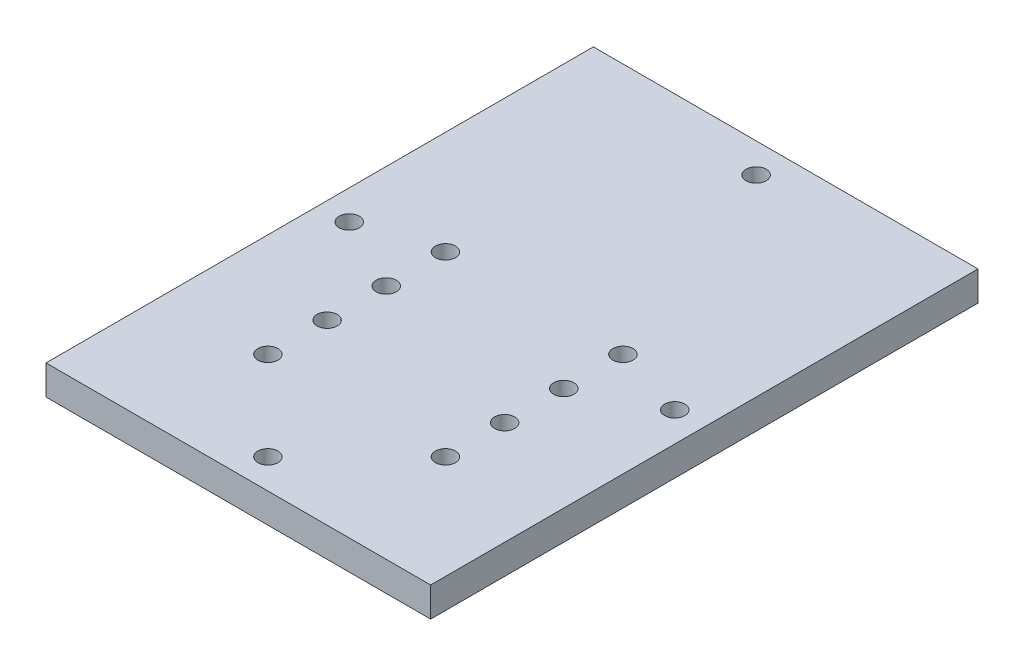
ISO-10303-21;
HEADER;
FILE_DESCRIPTION(('STEP AP214'),'2;1');
FILE_NAME('part.step','',(''),(''),'','','');
FILE_SCHEMA(('AUTOMOTIVE_DESIGN { 1 0 10303 214 1 1 1 1 }'));
ENDSEC;
DATA;
#1=APPLICATION_CONTEXT('core data for automotive mechanical design processes');
#2=APPLICATION_PROTOCOL_DEFINITION('international standard','automotive_design',2000,#1);
#3=PRODUCT_CONTEXT('',#1,'mechanical');
#4=PRODUCT('Part','Part','',(#3));
#5=PRODUCT_RELATED_PRODUCT_CATEGORY('part','',(#4));
#6=PRODUCT_DEFINITION_FORMATION('','',#4);
#7=PRODUCT_DEFINITION_CONTEXT('part definition',#1,'design');
#8=PRODUCT_DEFINITION('design','',#6,#7);
#9=PRODUCT_DEFINITION_SHAPE('','',#8);
#10=(LENGTH_UNIT() NAMED_UNIT(*) SI_UNIT(.MILLI.,.METRE.));
#11=(NAMED_UNIT(*) PLANE_ANGLE_UNIT() SI_UNIT($,.RADIAN.));
#12=(NAMED_UNIT(*) SI_UNIT($,.STERADIAN.) SOLID_ANGLE_UNIT());
#13=UNCERTAINTY_MEASURE_WITH_UNIT(LENGTH_MEASURE(1.E-05),#10,'distance_accuracy_value','');
#14=(GEOMETRIC_REPRESENTATION_CONTEXT(3) GLOBAL_UNCERTAINTY_ASSIGNED_CONTEXT((#13)) GLOBAL_UNIT_ASSIGNED_CONTEXT((#10,
#11,#12)) REPRESENTATION_CONTEXT('',''));
#15=CARTESIAN_POINT('',(0.,0.,0.));
#16=DIRECTION('',(0.,0.,1.));
#17=DIRECTION('',(1.,0.,0.));
#18=AXIS2_PLACEMENT_3D('',#15,#16,#17);
#19=CARTESIAN_POINT('',(0.,25.4,0.));
#20=DIRECTION('',(0.,1.,0.));
#21=DIRECTION('',(0.,0.,1.));
#22=AXIS2_PLACEMENT_3D('',#19,#20,#21);
#23=PLANE('',#22);
#24=CARTESIAN_POINT('',(-241.3,25.4,-203.2));
#25=DIRECTION('',(0.,1.,0.));
#26=DIRECTION('',(0.,0.,1.));
#27=AXIS2_PLACEMENT_3D('',#24,#25,#26);
#28=CIRCLE('',#27,8.64870000000001);
#29=CARTESIAN_POINT('',(-241.3,25.4,-194.5513));
#30=VERTEX_POINT('',#29);
#31=EDGE_CURVE('E179',#30,#30,#28,.T.);
#32=ORIENTED_EDGE('',*,*,#31,.F.);
#33=EDGE_LOOP('',(#32));
#34=FACE_BOUND('',#33,.T.);
#35=CARTESIAN_POINT('',(-241.3,25.4,-101.6));
#36=DIRECTION('',(0.,1.,0.));
#37=DIRECTION('',(0.,0.,1.));
#38=AXIS2_PLACEMENT_3D('',#35,#36,#37);
#39=CIRCLE('',#38,8.64870000000001);
#40=CARTESIAN_POINT('',(-241.3,25.4,-92.9513));
#41=VERTEX_POINT('',#40);
#42=EDGE_CURVE('E167',#41,#41,#39,.T.);
#43=ORIENTED_EDGE('',*,*,#42,.F.);
#44=EDGE_LOOP('',(#43));
#45=FACE_BOUND('',#44,.T.);
#46=CARTESIAN_POINT('',(-88.9,25.4,-203.2));
#47=DIRECTION('',(0.,1.,0.));
#48=DIRECTION('',(0.,0.,1.));
#49=AXIS2_PLACEMENT_3D('',#46,#47,#48);
#50=CIRCLE('',#49,8.64869999999993);
#51=CARTESIAN_POINT('',(-88.9,25.4,-194.5513));
#52=VERTEX_POINT('',#51);
#53=EDGE_CURVE('E155',#52,#52,#50,.T.);
#54=ORIENTED_EDGE('',*,*,#53,.F.);
#55=EDGE_LOOP('',(#54));
#56=FACE_BOUND('',#55,.T.);
#57=CARTESIAN_POINT('',(-88.9,25.4,-101.6));
#58=DIRECTION('',(0.,1.,0.));
#59=DIRECTION('',(0.,0.,1.));
#60=AXIS2_PLACEMENT_3D('',#57,#58,#59);
#61=CIRCLE('',#60,8.64869999999999);
#62=CARTESIAN_POINT('',(-88.9,25.4,-92.9513));
#63=VERTEX_POINT('',#62);
#64=EDGE_CURVE('E143',#63,#63,#61,.T.);
#65=ORIENTED_EDGE('',*,*,#64,.F.);
#66=EDGE_LOOP('',(#65));
#67=FACE_BOUND('',#66,.T.);
#68=CARTESIAN_POINT('',(-165.1,25.4,-25.4));
#69=DIRECTION('',(0.,1.,0.));
#70=DIRECTION('',(0.,0.,1.));
#71=AXIS2_PLACEMENT_3D('',#68,#69,#70);
#72=CIRCLE('',#71,8.64870000000001);
#73=CARTESIAN_POINT('',(-165.1,25.4,-16.7513));
#74=VERTEX_POINT('',#73);
#75=EDGE_CURVE('E131',#74,#74,#72,.T.);
#76=ORIENTED_EDGE('',*,*,#75,.F.);
#77=EDGE_LOOP('',(#76));
#78=FACE_BOUND('',#77,.T.);
#79=CARTESIAN_POINT('',(-165.1,25.4,-444.5));
#80=DIRECTION('',(0.,1.,0.));
#81=DIRECTION('',(0.,0.,1.));
#82=AXIS2_PLACEMENT_3D('',#79,#80,#81);
#83=CIRCLE('',#82,8.6487);
#84=CARTESIAN_POINT('',(-165.1,25.4,-435.8513));
#85=VERTEX_POINT('',#84);
#86=EDGE_CURVE('E110',#85,#85,#83,.T.);
#87=ORIENTED_EDGE('',*,*,#86,.F.);
#88=EDGE_LOOP('',(#87));
#89=FACE_BOUND('',#88,.T.);
#90=DIRECTION('',(0.,0.,-1.));
#91=VECTOR('',#90,1.);
#92=CARTESIAN_POINT('',(0.,25.4,0.));
#93=LINE('',#92,#91);
#94=CARTESIAN_POINT('',(0.,25.4,0.));
#95=VERTEX_POINT('',#94);
#96=CARTESIAN_POINT('',(0.,25.4,-469.9));
#97=VERTEX_POINT('',#96);
#98=EDGE_CURVE('E95',#95,#97,#93,.T.);
#99=ORIENTED_EDGE('',*,*,#98,.T.);
#100=DIRECTION('',(-1.,0.,0.));
#101=VECTOR('',#100,1.);
#102=CARTESIAN_POINT('',(0.,25.4,-469.9));
#103=LINE('',#102,#101);
#104=CARTESIAN_POINT('',(-330.2,25.4,-469.9));
#105=VERTEX_POINT('',#104);
#106=EDGE_CURVE('E90',#97,#105,#103,.T.);
#107=ORIENTED_EDGE('',*,*,#106,.T.);
#108=DIRECTION('',(0.,0.,1.));
#109=VECTOR('',#108,1.);
#110=CARTESIAN_POINT('',(-330.2,25.4,0.));
#111=LINE('',#110,#109);
#112=CARTESIAN_POINT('',(-330.2,25.4,0.));
#113=VERTEX_POINT('',#112);
#114=EDGE_CURVE('E93',#105,#113,#111,.T.);
#115=ORIENTED_EDGE('',*,*,#114,.T.);
#116=DIRECTION('',(1.,0.,0.));
#117=VECTOR('',#116,1.);
#118=CARTESIAN_POINT('',(0.,25.4,0.));
#119=LINE('',#118,#117);
#120=EDGE_CURVE('E60',#113,#95,#119,.T.);
#121=ORIENTED_EDGE('',*,*,#120,.T.);
#122=EDGE_LOOP('',(#99,#107,#115,#121));
#123=FACE_BOUND('',#122,.T.);
#124=CARTESIAN_POINT('',(-25.4,25.4,-234.95));
#125=DIRECTION('',(0.,1.,0.));
#126=DIRECTION('',(0.,0.,1.));
#127=AXIS2_PLACEMENT_3D('',#124,#125,#126);
#128=CIRCLE('',#127,8.6487);
#129=CARTESIAN_POINT('',(-25.4,25.4,-226.3013));
#130=VERTEX_POINT('',#129);
#131=EDGE_CURVE('E125',#130,#130,#128,.T.);
#132=ORIENTED_EDGE('',*,*,#131,.F.);
#133=EDGE_LOOP('',(#132));
#134=FACE_BOUND('',#133,.T.);
#135=CARTESIAN_POINT('',(-304.8,25.4,-234.95));
#136=DIRECTION('',(0.,1.,0.));
#137=DIRECTION('',(0.,0.,1.));
#138=AXIS2_PLACEMENT_3D('',#135,#136,#137);
#139=CIRCLE('',#138,8.64870000000001);
#140=CARTESIAN_POINT('',(-304.8,25.4,-226.3013));
#141=VERTEX_POINT('',#140);
#142=EDGE_CURVE('E137',#141,#141,#139,.T.);
#143=ORIENTED_EDGE('',*,*,#142,.F.);
#144=EDGE_LOOP('',(#143));
#145=FACE_BOUND('',#144,.T.);
#146=CARTESIAN_POINT('',(-88.9,25.4,-152.4));
#147=DIRECTION('',(0.,1.,0.));
#148=DIRECTION('',(0.,0.,1.));
#149=AXIS2_PLACEMENT_3D('',#146,#147,#148);
#150=CIRCLE('',#149,8.64869999999999);
#151=CARTESIAN_POINT('',(-88.9,25.4,-143.7513));
#152=VERTEX_POINT('',#151);
#153=EDGE_CURVE('E149',#152,#152,#150,.T.);
#154=ORIENTED_EDGE('',*,*,#153,.F.);
#155=EDGE_LOOP('',(#154));
#156=FACE_BOUND('',#155,.T.);
#157=CARTESIAN_POINT('',(-88.9,25.4,-254.));
#158=DIRECTION('',(0.,1.,0.));
#159=DIRECTION('',(0.,0.,1.));
#160=AXIS2_PLACEMENT_3D('',#157,#158,#159);
#161=CIRCLE('',#160,8.64869999999982);
#162=CARTESIAN_POINT('',(-88.9,25.4,-245.3513));
#163=VERTEX_POINT('',#162);
#164=EDGE_CURVE('E161',#163,#163,#161,.T.);
#165=ORIENTED_EDGE('',*,*,#164,.F.);
#166=EDGE_LOOP('',(#165));
#167=FACE_BOUND('',#166,.T.);
#168=CARTESIAN_POINT('',(-241.3,25.4,-152.4));
#169=DIRECTION('',(0.,1.,0.));
#170=DIRECTION('',(0.,0.,1.));
#171=AXIS2_PLACEMENT_3D('',#168,#169,#170);
#172=CIRCLE('',#171,8.64870000000001);
#173=CARTESIAN_POINT('',(-241.3,25.4,-143.7513));
#174=VERTEX_POINT('',#173);
#175=EDGE_CURVE('E173',#174,#174,#172,.T.);
#176=ORIENTED_EDGE('',*,*,#175,.F.);
#177=EDGE_LOOP('',(#176));
#178=FACE_BOUND('',#177,.T.);
#179=CARTESIAN_POINT('',(-241.3,25.4,-254.));
#180=DIRECTION('',(0.,1.,0.));
#181=DIRECTION('',(0.,0.,1.));
#182=AXIS2_PLACEMENT_3D('',#179,#180,#181);
#183=CIRCLE('',#182,8.6487);
#184=CARTESIAN_POINT('',(-241.3,25.4,-245.3513));
#185=VERTEX_POINT('',#184);
#186=EDGE_CURVE('E185',#185,#185,#183,.T.);
#187=ORIENTED_EDGE('',*,*,#186,.F.);
#188=EDGE_LOOP('',(#187));
#189=FACE_BOUND('',#188,.T.);
#190=ADVANCED_FACE('F43',(#34,#45,#56,#67,#78,#89,#123,#134,#145,#156,#167,#178,#189),#23,.T.);
#191=CARTESIAN_POINT('',(0.,0.,0.));
#192=DIRECTION('',(0.,1.,0.));
#193=DIRECTION('',(0.,0.,1.));
#194=AXIS2_PLACEMENT_3D('',#191,#192,#193);
#195=PLANE('',#194);
#196=DIRECTION('',(0.,0.,-1.));
#197=VECTOR('',#196,1.);
#198=CARTESIAN_POINT('',(0.,0.,0.));
#199=LINE('',#198,#197);
#200=CARTESIAN_POINT('',(0.,0.,0.));
#201=VERTEX_POINT('',#200);
#202=CARTESIAN_POINT('',(0.,0.,-469.9));
#203=VERTEX_POINT('',#202);
#204=EDGE_CURVE('E107',#201,#203,#199,.T.);
#205=ORIENTED_EDGE('',*,*,#204,.F.);
#206=DIRECTION('',(1.,0.,0.));
#207=VECTOR('',#206,1.);
#208=CARTESIAN_POINT('',(0.,0.,0.));
#209=LINE('',#208,#207);
#210=CARTESIAN_POINT('',(-330.2,0.,0.));
#211=VERTEX_POINT('',#210);
#212=EDGE_CURVE('E83',#211,#201,#209,.T.);
#213=ORIENTED_EDGE('',*,*,#212,.F.);
#214=DIRECTION('',(0.,0.,1.));
#215=VECTOR('',#214,1.);
#216=CARTESIAN_POINT('',(-330.2,0.,0.));
#217=LINE('',#216,#215);
#218=CARTESIAN_POINT('',(-330.2,0.,-469.9));
#219=VERTEX_POINT('',#218);
#220=EDGE_CURVE('E77',#219,#211,#217,.T.);
#221=ORIENTED_EDGE('',*,*,#220,.F.);
#222=DIRECTION('',(-1.,0.,0.));
#223=VECTOR('',#222,1.);
#224=CARTESIAN_POINT('',(0.,0.,-469.9));
#225=LINE('',#224,#223);
#226=EDGE_CURVE('E99',#203,#219,#225,.T.);
#227=ORIENTED_EDGE('',*,*,#226,.F.);
#228=EDGE_LOOP('',(#205,#213,#221,#227));
#229=FACE_BOUND('',#228,.T.);
#230=CARTESIAN_POINT('',(-165.1,0.,-444.5));
#231=DIRECTION('',(0.,1.,0.));
#232=DIRECTION('',(0.,0.,1.));
#233=AXIS2_PLACEMENT_3D('',#230,#231,#232);
#234=CIRCLE('',#233,8.6487);
#235=CARTESIAN_POINT('',(-165.1,0.,-435.8513));
#236=VERTEX_POINT('',#235);
#237=EDGE_CURVE('E122',#236,#236,#234,.T.);
#238=ORIENTED_EDGE('',*,*,#237,.T.);
#239=EDGE_LOOP('',(#238));
#240=FACE_BOUND('',#239,.T.);
#241=CARTESIAN_POINT('',(-25.4,0.,-234.95));
#242=DIRECTION('',(0.,1.,0.));
#243=DIRECTION('',(0.,0.,1.));
#244=AXIS2_PLACEMENT_3D('',#241,#242,#243);
#245=CIRCLE('',#244,8.6487);
#246=CARTESIAN_POINT('',(-25.4,0.,-226.3013));
#247=VERTEX_POINT('',#246);
#248=EDGE_CURVE('E128',#247,#247,#245,.T.);
#249=ORIENTED_EDGE('',*,*,#248,.T.);
#250=EDGE_LOOP('',(#249));
#251=FACE_BOUND('',#250,.T.);
#252=CARTESIAN_POINT('',(-165.1,0.,-25.4));
#253=DIRECTION('',(0.,1.,0.));
#254=DIRECTION('',(0.,0.,1.));
#255=AXIS2_PLACEMENT_3D('',#252,#253,#254);
#256=CIRCLE('',#255,8.64870000000001);
#257=CARTESIAN_POINT('',(-165.1,0.,-16.7513));
#258=VERTEX_POINT('',#257);
#259=EDGE_CURVE('E134',#258,#258,#256,.T.);
#260=ORIENTED_EDGE('',*,*,#259,.T.);
#261=EDGE_LOOP('',(#260));
#262=FACE_BOUND('',#261,.T.);
#263=CARTESIAN_POINT('',(-304.8,0.,-234.95));
#264=DIRECTION('',(0.,1.,0.));
#265=DIRECTION('',(0.,0.,1.));
#266=AXIS2_PLACEMENT_3D('',#263,#264,#265);
#267=CIRCLE('',#266,8.64870000000001);
#268=CARTESIAN_POINT('',(-304.8,0.,-226.3013));
#269=VERTEX_POINT('',#268);
#270=EDGE_CURVE('E140',#269,#269,#267,.T.);
#271=ORIENTED_EDGE('',*,*,#270,.T.);
#272=EDGE_LOOP('',(#271));
#273=FACE_BOUND('',#272,.T.);
#274=CARTESIAN_POINT('',(-88.9,0.,-101.6));
#275=DIRECTION('',(0.,1.,0.));
#276=DIRECTION('',(0.,0.,1.));
#277=AXIS2_PLACEMENT_3D('',#274,#275,#276);
#278=CIRCLE('',#277,8.64869999999999);
#279=CARTESIAN_POINT('',(-88.9,0.,-92.9513));
#280=VERTEX_POINT('',#279);
#281=EDGE_CURVE('E146',#280,#280,#278,.T.);
#282=ORIENTED_EDGE('',*,*,#281,.T.);
#283=EDGE_LOOP('',(#282));
#284=FACE_BOUND('',#283,.T.);
#285=CARTESIAN_POINT('',(-88.9,0.,-152.4));
#286=DIRECTION('',(0.,1.,0.));
#287=DIRECTION('',(0.,0.,1.));
#288=AXIS2_PLACEMENT_3D('',#285,#286,#287);
#289=CIRCLE('',#288,8.64869999999999);
#290=CARTESIAN_POINT('',(-88.9,0.,-143.7513));
#291=VERTEX_POINT('',#290);
#292=EDGE_CURVE('E152',#291,#291,#289,.T.);
#293=ORIENTED_EDGE('',*,*,#292,.T.);
#294=EDGE_LOOP('',(#293));
#295=FACE_BOUND('',#294,.T.);
#296=CARTESIAN_POINT('',(-88.9,0.,-203.2));
#297=DIRECTION('',(0.,1.,0.));
#298=DIRECTION('',(0.,0.,1.));
#299=AXIS2_PLACEMENT_3D('',#296,#297,#298);
#300=CIRCLE('',#299,8.64869999999993);
#301=CARTESIAN_POINT('',(-88.9,0.,-194.5513));
#302=VERTEX_POINT('',#301);
#303=EDGE_CURVE('E158',#302,#302,#300,.T.);
#304=ORIENTED_EDGE('',*,*,#303,.T.);
#305=EDGE_LOOP('',(#304));
#306=FACE_BOUND('',#305,.T.);
#307=CARTESIAN_POINT('',(-88.9,0.,-254.));
#308=DIRECTION('',(0.,1.,0.));
#309=DIRECTION('',(0.,0.,1.));
#310=AXIS2_PLACEMENT_3D('',#307,#308,#309);
#311=CIRCLE('',#310,8.64869999999982);
#312=CARTESIAN_POINT('',(-88.9,0.,-245.3513));
#313=VERTEX_POINT('',#312);
#314=EDGE_CURVE('E164',#313,#313,#311,.T.);
#315=ORIENTED_EDGE('',*,*,#314,.T.);
#316=EDGE_LOOP('',(#315));
#317=FACE_BOUND('',#316,.T.);
#318=CARTESIAN_POINT('',(-241.3,0.,-101.6));
#319=DIRECTION('',(0.,1.,0.));
#320=DIRECTION('',(0.,0.,1.));
#321=AXIS2_PLACEMENT_3D('',#318,#319,#320);
#322=CIRCLE('',#321,8.64870000000001);
#323=CARTESIAN_POINT('',(-241.3,0.,-92.9513));
#324=VERTEX_POINT('',#323);
#325=EDGE_CURVE('E170',#324,#324,#322,.T.);
#326=ORIENTED_EDGE('',*,*,#325,.T.);
#327=EDGE_LOOP('',(#326));
#328=FACE_BOUND('',#327,.T.);
#329=CARTESIAN_POINT('',(-241.3,0.,-152.4));
#330=DIRECTION('',(0.,1.,0.));
#331=DIRECTION('',(0.,0.,1.));
#332=AXIS2_PLACEMENT_3D('',#329,#330,#331);
#333=CIRCLE('',#332,8.64870000000001);
#334=CARTESIAN_POINT('',(-241.3,0.,-143.7513));
#335=VERTEX_POINT('',#334);
#336=EDGE_CURVE('E176',#335,#335,#333,.T.);
#337=ORIENTED_EDGE('',*,*,#336,.T.);
#338=EDGE_LOOP('',(#337));
#339=FACE_BOUND('',#338,.T.);
#340=CARTESIAN_POINT('',(-241.3,0.,-203.2));
#341=DIRECTION('',(0.,1.,0.));
#342=DIRECTION('',(0.,0.,1.));
#343=AXIS2_PLACEMENT_3D('',#340,#341,#342);
#344=CIRCLE('',#343,8.64870000000001);
#345=CARTESIAN_POINT('',(-241.3,0.,-194.5513));
#346=VERTEX_POINT('',#345);
#347=EDGE_CURVE('E182',#346,#346,#344,.T.);
#348=ORIENTED_EDGE('',*,*,#347,.T.);
#349=EDGE_LOOP('',(#348));
#350=FACE_BOUND('',#349,.T.);
#351=CARTESIAN_POINT('',(-241.3,0.,-254.));
#352=DIRECTION('',(0.,1.,0.));
#353=DIRECTION('',(0.,0.,1.));
#354=AXIS2_PLACEMENT_3D('',#351,#352,#353);
#355=CIRCLE('',#354,8.6487);
#356=CARTESIAN_POINT('',(-241.3,0.,-245.3513));
#357=VERTEX_POINT('',#356);
#358=EDGE_CURVE('E188',#357,#357,#355,.T.);
#359=ORIENTED_EDGE('',*,*,#358,.T.);
#360=EDGE_LOOP('',(#359));
#361=FACE_BOUND('',#360,.T.);
#362=ADVANCED_FACE('F118',(#229,#240,#251,#262,#273,#284,#295,#306,#317,#328,#339,#350,#361),
#195,.F.);
#363=CARTESIAN_POINT('',(0.,25.4,0.));
#364=DIRECTION('',(-1.,0.,0.));
#365=DIRECTION('',(0.,0.,1.));
#366=AXIS2_PLACEMENT_3D('',#363,#364,#365);
#367=PLANE('',#366);
#368=ORIENTED_EDGE('',*,*,#204,.T.);
#369=DIRECTION('',(0.,-1.,0.));
#370=VECTOR('',#369,1.);
#371=CARTESIAN_POINT('',(0.,25.4,-469.9));
#372=LINE('',#371,#370);
#373=EDGE_CURVE('E11',#97,#203,#372,.T.);
#374=ORIENTED_EDGE('',*,*,#373,.F.);
#375=ORIENTED_EDGE('',*,*,#98,.F.);
#376=DIRECTION('',(0.,-1.,0.));
#377=VECTOR('',#376,1.);
#378=CARTESIAN_POINT('',(0.,25.4,0.));
#379=LINE('',#378,#377);
#380=EDGE_CURVE('E103',#95,#201,#379,.T.);
#381=ORIENTED_EDGE('',*,*,#380,.T.);
#382=EDGE_LOOP('',(#368,#374,#375,#381));
#383=FACE_BOUND('',#382,.T.);
#384=ADVANCED_FACE('F45',(#383),#367,.F.);
#385=CARTESIAN_POINT('',(0.,25.4,-469.9));
#386=DIRECTION('',(0.,0.,1.));
#387=DIRECTION('',(1.,0.,0.));
#388=AXIS2_PLACEMENT_3D('',#385,#386,#387);
#389=PLANE('',#388);
#390=ORIENTED_EDGE('',*,*,#226,.T.);
#391=DIRECTION('',(0.,-1.,0.));
#392=VECTOR('',#391,1.);
#393=CARTESIAN_POINT('',(-330.2,25.4,-469.9));
#394=LINE('',#393,#392);
#395=EDGE_CURVE('E52',#105,#219,#394,.T.);
#396=ORIENTED_EDGE('',*,*,#395,.F.);
#397=ORIENTED_EDGE('',*,*,#106,.F.);
#398=ORIENTED_EDGE('',*,*,#373,.T.);
#399=EDGE_LOOP('',(#390,#396,#397,#398));
#400=FACE_BOUND('',#399,.T.);
#401=ADVANCED_FACE('F98',(#400),#389,.F.);
#402=CARTESIAN_POINT('',(-330.2,25.4,0.));
#403=DIRECTION('',(1.,0.,0.));
#404=DIRECTION('',(0.,0.,-1.));
#405=AXIS2_PLACEMENT_3D('',#402,#403,#404);
#406=PLANE('',#405);
#407=ORIENTED_EDGE('',*,*,#220,.T.);
#408=DIRECTION('',(0.,-1.,0.));
#409=VECTOR('',#408,1.);
#410=CARTESIAN_POINT('',(-330.2,25.4,0.));
#411=LINE('',#410,#409);
#412=EDGE_CURVE('E100',#113,#211,#411,.T.);
#413=ORIENTED_EDGE('',*,*,#412,.F.);
#414=ORIENTED_EDGE('',*,*,#114,.F.);
#415=ORIENTED_EDGE('',*,*,#395,.T.);
#416=EDGE_LOOP('',(#407,#413,#414,#415));
#417=FACE_BOUND('',#416,.T.);
#418=ADVANCED_FACE('F101',(#417),#406,.F.);
#419=CARTESIAN_POINT('',(0.,25.4,0.));
#420=DIRECTION('',(0.,0.,-1.));
#421=DIRECTION('',(-1.,0.,0.));
#422=AXIS2_PLACEMENT_3D('',#419,#420,#421);
#423=PLANE('',#422);
#424=ORIENTED_EDGE('',*,*,#212,.T.);
#425=ORIENTED_EDGE('',*,*,#380,.F.);
#426=ORIENTED_EDGE('',*,*,#120,.F.);
#427=ORIENTED_EDGE('',*,*,#412,.T.);
#428=EDGE_LOOP('',(#424,#425,#426,#427));
#429=FACE_BOUND('',#428,.T.);
#430=ADVANCED_FACE('F115',(#429),#423,.F.);
#431=CARTESIAN_POINT('',(-165.1,25.4,-444.5));
#432=DIRECTION('',(0.,-1.,0.));
#433=DIRECTION('',(0.,0.,-1.));
#434=AXIS2_PLACEMENT_3D('',#431,#432,#433);
#435=CYLINDRICAL_SURFACE('',#434,8.6487);
#436=ORIENTED_EDGE('',*,*,#86,.T.);
#437=EDGE_LOOP('',(#436));
#438=FACE_BOUND('',#437,.T.);
#439=ORIENTED_EDGE('',*,*,#237,.F.);
#440=EDGE_LOOP('',(#439));
#441=FACE_BOUND('',#440,.T.);
#442=ADVANCED_FACE('F207',(#438,#441),#435,.F.);
#443=CARTESIAN_POINT('',(-25.4,25.4,-234.95));
#444=DIRECTION('',(0.,-1.,0.));
#445=DIRECTION('',(0.,0.,-1.));
#446=AXIS2_PLACEMENT_3D('',#443,#444,#445);
#447=CYLINDRICAL_SURFACE('',#446,8.6487);
#448=ORIENTED_EDGE('',*,*,#131,.T.);
#449=EDGE_LOOP('',(#448));
#450=FACE_BOUND('',#449,.T.);
#451=ORIENTED_EDGE('',*,*,#248,.F.);
#452=EDGE_LOOP('',(#451));
#453=FACE_BOUND('',#452,.T.);
#454=ADVANCED_FACE('F255',(#450,#453),#447,.F.);
#455=CARTESIAN_POINT('',(-165.1,25.4,-25.4));
#456=DIRECTION('',(0.,-1.,0.));
#457=DIRECTION('',(0.,0.,-1.));
#458=AXIS2_PLACEMENT_3D('',#455,#456,#457);
#459=CYLINDRICAL_SURFACE('',#458,8.64870000000001);
#460=ORIENTED_EDGE('',*,*,#75,.T.);
#461=EDGE_LOOP('',(#460));
#462=FACE_BOUND('',#461,.T.);
#463=ORIENTED_EDGE('',*,*,#259,.F.);
#464=EDGE_LOOP('',(#463));
#465=FACE_BOUND('',#464,.T.);
#466=ADVANCED_FACE('F263',(#462,#465),#459,.F.);
#467=CARTESIAN_POINT('',(-304.8,25.4,-234.95));
#468=DIRECTION('',(0.,-1.,0.));
#469=DIRECTION('',(0.,0.,-1.));
#470=AXIS2_PLACEMENT_3D('',#467,#468,#469);
#471=CYLINDRICAL_SURFACE('',#470,8.64870000000001);
#472=ORIENTED_EDGE('',*,*,#142,.T.);
#473=EDGE_LOOP('',(#472));
#474=FACE_BOUND('',#473,.T.);
#475=ORIENTED_EDGE('',*,*,#270,.F.);
#476=EDGE_LOOP('',(#475));
#477=FACE_BOUND('',#476,.T.);
#478=ADVANCED_FACE('F271',(#474,#477),#471,.F.);
#479=CARTESIAN_POINT('',(-88.9,25.4,-101.6));
#480=DIRECTION('',(0.,-1.,0.));
#481=DIRECTION('',(0.,0.,-1.));
#482=AXIS2_PLACEMENT_3D('',#479,#480,#481);
#483=CYLINDRICAL_SURFACE('',#482,8.64869999999999);
#484=ORIENTED_EDGE('',*,*,#64,.T.);
#485=EDGE_LOOP('',(#484));
#486=FACE_BOUND('',#485,.T.);
#487=ORIENTED_EDGE('',*,*,#281,.F.);
#488=EDGE_LOOP('',(#487));
#489=FACE_BOUND('',#488,.T.);
#490=ADVANCED_FACE('F280',(#486,#489),#483,.F.);
#491=CARTESIAN_POINT('',(-88.9,25.4,-152.4));
#492=DIRECTION('',(0.,-1.,0.));
#493=DIRECTION('',(0.,0.,-1.));
#494=AXIS2_PLACEMENT_3D('',#491,#492,#493);
#495=CYLINDRICAL_SURFACE('',#494,8.64869999999999);
#496=ORIENTED_EDGE('',*,*,#153,.T.);
#497=EDGE_LOOP('',(#496));
#498=FACE_BOUND('',#497,.T.);
#499=ORIENTED_EDGE('',*,*,#292,.F.);
#500=EDGE_LOOP('',(#499));
#501=FACE_BOUND('',#500,.T.);
#502=ADVANCED_FACE('F289',(#498,#501),#495,.F.);
#503=CARTESIAN_POINT('',(-88.9,25.4,-203.2));
#504=DIRECTION('',(0.,-1.,0.));
#505=DIRECTION('',(0.,0.,-1.));
#506=AXIS2_PLACEMENT_3D('',#503,#504,#505);
#507=CYLINDRICAL_SURFACE('',#506,8.64869999999993);
#508=ORIENTED_EDGE('',*,*,#53,.T.);
#509=EDGE_LOOP('',(#508));
#510=FACE_BOUND('',#509,.T.);
#511=ORIENTED_EDGE('',*,*,#303,.F.);
#512=EDGE_LOOP('',(#511));
#513=FACE_BOUND('',#512,.T.);
#514=ADVANCED_FACE('F298',(#510,#513),#507,.F.);
#515=CARTESIAN_POINT('',(-88.9,25.4,-254.));
#516=DIRECTION('',(0.,-1.,0.));
#517=DIRECTION('',(0.,0.,-1.));
#518=AXIS2_PLACEMENT_3D('',#515,#516,#517);
#519=CYLINDRICAL_SURFACE('',#518,8.64869999999982);
#520=ORIENTED_EDGE('',*,*,#164,.T.);
#521=EDGE_LOOP('',(#520));
#522=FACE_BOUND('',#521,.T.);
#523=ORIENTED_EDGE('',*,*,#314,.F.);
#524=EDGE_LOOP('',(#523));
#525=FACE_BOUND('',#524,.T.);
#526=ADVANCED_FACE('F307',(#522,#525),#519,.F.);
#527=CARTESIAN_POINT('',(-241.3,25.4,-101.6));
#528=DIRECTION('',(0.,-1.,0.));
#529=DIRECTION('',(0.,0.,-1.));
#530=AXIS2_PLACEMENT_3D('',#527,#528,#529);
#531=CYLINDRICAL_SURFACE('',#530,8.64870000000001);
#532=ORIENTED_EDGE('',*,*,#42,.T.);
#533=EDGE_LOOP('',(#532));
#534=FACE_BOUND('',#533,.T.);
#535=ORIENTED_EDGE('',*,*,#325,.F.);
#536=EDGE_LOOP('',(#535));
#537=FACE_BOUND('',#536,.T.);
#538=ADVANCED_FACE('F316',(#534,#537),#531,.F.);
#539=CARTESIAN_POINT('',(-241.3,25.4,-152.4));
#540=DIRECTION('',(0.,-1.,0.));
#541=DIRECTION('',(0.,0.,-1.));
#542=AXIS2_PLACEMENT_3D('',#539,#540,#541);
#543=CYLINDRICAL_SURFACE('',#542,8.64870000000001);
#544=ORIENTED_EDGE('',*,*,#175,.T.);
#545=EDGE_LOOP('',(#544));
#546=FACE_BOUND('',#545,.T.);
#547=ORIENTED_EDGE('',*,*,#336,.F.);
#548=EDGE_LOOP('',(#547));
#549=FACE_BOUND('',#548,.T.);
#550=ADVANCED_FACE('F325',(#546,#549),#543,.F.);
#551=CARTESIAN_POINT('',(-241.3,25.4,-203.2));
#552=DIRECTION('',(0.,-1.,0.));
#553=DIRECTION('',(0.,0.,-1.));
#554=AXIS2_PLACEMENT_3D('',#551,#552,#553);
#555=CYLINDRICAL_SURFACE('',#554,8.64870000000001);
#556=ORIENTED_EDGE('',*,*,#31,.T.);
#557=EDGE_LOOP('',(#556));
#558=FACE_BOUND('',#557,.T.);
#559=ORIENTED_EDGE('',*,*,#347,.F.);
#560=EDGE_LOOP('',(#559));
#561=FACE_BOUND('',#560,.T.);
#562=ADVANCED_FACE('F334',(#558,#561),#555,.F.);
#563=CARTESIAN_POINT('',(-241.3,25.4,-254.));
#564=DIRECTION('',(0.,-1.,0.));
#565=DIRECTION('',(0.,0.,-1.));
#566=AXIS2_PLACEMENT_3D('',#563,#564,#565);
#567=CYLINDRICAL_SURFACE('',#566,8.6487);
#568=ORIENTED_EDGE('',*,*,#186,.T.);
#569=EDGE_LOOP('',(#568));
#570=FACE_BOUND('',#569,.T.);
#571=ORIENTED_EDGE('',*,*,#358,.F.);
#572=EDGE_LOOP('',(#571));
#573=FACE_BOUND('',#572,.T.);
#574=ADVANCED_FACE('F194',(#570,#573),#567,.F.);
#575=CLOSED_SHELL('',(#190,#362,#384,#401,#418,#430,#442,#454,#466,#478,#490,#502,#514,#526,
#538,#550,#562,#574));
#576=MANIFOLD_SOLID_BREP('B2',#575);
#577=ADVANCED_BREP_SHAPE_REPRESENTATION('',(#18,#576),#14);
#578=SHAPE_DEFINITION_REPRESENTATION(#9,#577);
ENDSEC;
END-ISO-10303-21;
